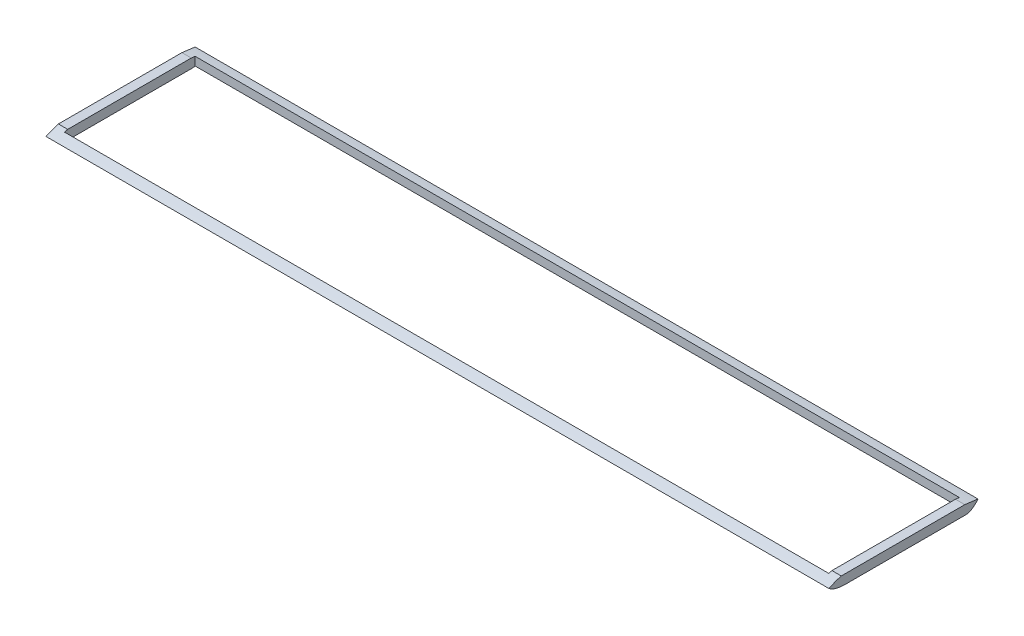
ISO-10303-21;
HEADER;
FILE_DESCRIPTION(('STEP AP214'),'2;1');
FILE_NAME('part.step','',(''),(''),'','','');
FILE_SCHEMA(('AUTOMOTIVE_DESIGN { 1 0 10303 214 1 1 1 1 }'));
ENDSEC;
DATA;
#1=APPLICATION_CONTEXT('core data for automotive mechanical design processes');
#2=APPLICATION_PROTOCOL_DEFINITION('international standard','automotive_design',2000,#1);
#3=PRODUCT_CONTEXT('',#1,'mechanical');
#4=PRODUCT('Part','Part','',(#3));
#5=PRODUCT_RELATED_PRODUCT_CATEGORY('part','',(#4));
#6=PRODUCT_DEFINITION_FORMATION('','',#4);
#7=PRODUCT_DEFINITION_CONTEXT('part definition',#1,'design');
#8=PRODUCT_DEFINITION('design','',#6,#7);
#9=PRODUCT_DEFINITION_SHAPE('','',#8);
#10=(LENGTH_UNIT() NAMED_UNIT(*) SI_UNIT(.MILLI.,.METRE.));
#11=(NAMED_UNIT(*) PLANE_ANGLE_UNIT() SI_UNIT($,.RADIAN.));
#12=(NAMED_UNIT(*) SI_UNIT($,.STERADIAN.) SOLID_ANGLE_UNIT());
#13=UNCERTAINTY_MEASURE_WITH_UNIT(LENGTH_MEASURE(1.E-05),#10,'distance_accuracy_value','');
#14=(GEOMETRIC_REPRESENTATION_CONTEXT(3) GLOBAL_UNCERTAINTY_ASSIGNED_CONTEXT((#13)) GLOBAL_UNIT_ASSIGNED_CONTEXT((#10,
#11,#12)) REPRESENTATION_CONTEXT('',''));
#15=CARTESIAN_POINT('',(0.,0.,0.));
#16=DIRECTION('',(0.,0.,1.));
#17=DIRECTION('',(1.,0.,0.));
#18=AXIS2_PLACEMENT_3D('',#15,#16,#17);
#19=CARTESIAN_POINT('',(0.,6.35,0.));
#20=DIRECTION('',(0.,1.,0.));
#21=DIRECTION('',(0.,0.,1.));
#22=AXIS2_PLACEMENT_3D('',#19,#20,#21);
#23=PLANE('',#22);
#24=DIRECTION('',(1.,0.,0.));
#25=VECTOR('',#24,1.);
#26=CARTESIAN_POINT('',(-533.4,6.35,86.8082266908897));
#27=LINE('',#26,#25);
#28=CARTESIAN_POINT('',(0.,6.35000000253614,86.8082266820428));
#29=VERTEX_POINT('',#28);
#30=CARTESIAN_POINT('',(-6.34999999999997,6.35000000253614,86.8082266820428));
#31=VERTEX_POINT('',#30);
#32=EDGE_CURVE('E11',#29,#31,#27,.F.);
#33=ORIENTED_EDGE('',*,*,#32,.F.);
#34=DIRECTION('',(0.,0.,-1.));
#35=VECTOR('',#34,1.);
#36=CARTESIAN_POINT('',(0.,6.35,0.));
#37=LINE('',#36,#35);
#38=CARTESIAN_POINT('',(0.,6.35000000001549,2.66307180460059));
#39=VERTEX_POINT('',#38);
#40=EDGE_CURVE('E233',#29,#39,#37,.T.);
#41=ORIENTED_EDGE('',*,*,#40,.T.);
#42=DIRECTION('',(1.,0.,0.));
#43=VECTOR('',#42,1.);
#44=CARTESIAN_POINT('',(-533.4,6.35,2.66307180445248));
#45=LINE('',#44,#43);
#46=CARTESIAN_POINT('',(-6.34999999999997,6.35,2.66307180445248));
#47=VERTEX_POINT('',#46);
#48=EDGE_CURVE('E289',#47,#39,#45,.T.);
#49=ORIENTED_EDGE('',*,*,#48,.F.);
#50=DIRECTION('',(0.,0.,1.));
#51=VECTOR('',#50,1.);
#52=CARTESIAN_POINT('',(-6.34999999999999,6.35,0.));
#53=LINE('',#52,#51);
#54=EDGE_CURVE('E235',#47,#31,#53,.T.);
#55=ORIENTED_EDGE('',*,*,#54,.T.);
#56=EDGE_LOOP('',(#33,#41,#49,#55));
#57=FACE_BOUND('',#56,.T.);
#58=ADVANCED_FACE('F44',(#57),#23,.T.);
#59=CARTESIAN_POINT('',(0.,0.,0.));
#60=DIRECTION('',(0.,1.,0.));
#61=DIRECTION('',(0.,0.,1.));
#62=AXIS2_PLACEMENT_3D('',#59,#60,#61);
#63=PLANE('',#62);
#64=DIRECTION('',(0.,0.,-1.));
#65=VECTOR('',#64,1.);
#66=CARTESIAN_POINT('',(-527.05,0.,0.));
#67=LINE('',#66,#65);
#68=CARTESIAN_POINT('',(-527.05,0.,84.6410730931549));
#69=VERTEX_POINT('',#68);
#70=CARTESIAN_POINT('',(-527.05,0.,1.6702089535618));
#71=VERTEX_POINT('',#70);
#72=EDGE_CURVE('E241',#69,#71,#67,.T.);
#73=ORIENTED_EDGE('',*,*,#72,.F.);
#74=DIRECTION('',(1.,0.,0.));
#75=VECTOR('',#74,1.);
#76=CARTESIAN_POINT('',(-533.4,0.,84.6410730931549));
#77=LINE('',#76,#75);
#78=CARTESIAN_POINT('',(-533.4,0.,84.6410730931549));
#79=VERTEX_POINT('',#78);
#80=EDGE_CURVE('E502',#79,#69,#77,.T.);
#81=ORIENTED_EDGE('',*,*,#80,.F.);
#82=DIRECTION('',(0.,0.,-1.));
#83=VECTOR('',#82,1.);
#84=CARTESIAN_POINT('',(-533.4,0.,0.));
#85=LINE('',#84,#83);
#86=CARTESIAN_POINT('',(-533.4,0.,1.6702089535618));
#87=VERTEX_POINT('',#86);
#88=EDGE_CURVE('E168',#79,#87,#85,.T.);
#89=ORIENTED_EDGE('',*,*,#88,.T.);
#90=DIRECTION('',(1.,0.,0.));
#91=VECTOR('',#90,1.);
#92=CARTESIAN_POINT('',(-533.4,0.,1.67020895356183));
#93=LINE('',#92,#91);
#94=EDGE_CURVE('E285',#87,#71,#93,.T.);
#95=ORIENTED_EDGE('',*,*,#94,.T.);
#96=EDGE_LOOP('',(#73,#81,#89,#95));
#97=FACE_BOUND('',#96,.T.);
#98=ADVANCED_FACE('F203',(#97),#63,.F.);
#99=CARTESIAN_POINT('',(-6.34999999999999,6.35,0.));
#100=DIRECTION('',(1.,0.,0.));
#101=DIRECTION('',(0.,0.,-1.));
#102=AXIS2_PLACEMENT_3D('',#99,#100,#101);
#103=PLANE('',#102);
#104=DIRECTION('',(0.,0.,1.));
#105=VECTOR('',#104,1.);
#106=CARTESIAN_POINT('',(-6.34999999999999,0.,0.));
#107=LINE('',#106,#105);
#108=CARTESIAN_POINT('',(-6.34999999999997,0.,1.67020895356183));
#109=VERTEX_POINT('',#108);
#110=CARTESIAN_POINT('',(-6.34999999999997,0.,84.6410730931549));
#111=VERTEX_POINT('',#110);
#112=EDGE_CURVE('E246',#109,#111,#107,.T.);
#113=ORIENTED_EDGE('',*,*,#112,.T.);
#114=CARTESIAN_POINT('',(-6.34999999999997,0.,84.6410730931549));
#115=CARTESIAN_POINT('',(-6.34999999999997,0.114428996716773,91.5442972351769));
#116=CARTESIAN_POINT('',(-6.34999999999997,3.175,95.25));
#117=B_SPLINE_CURVE_WITH_KNOTS('',2,(#114,#115,#116),.UNSPECIFIED.,.F.,.F.,(3,3),(0.,1.),.UNSPECIFIED.);
#118=CARTESIAN_POINT('',(-6.34999999999997,0.405903763749544,88.9));
#119=VERTEX_POINT('',#118);
#120=EDGE_CURVE('E543',#111,#119,#117,.T.);
#121=ORIENTED_EDGE('',*,*,#120,.T.);
#122=DIRECTION('',(0.,-1.,0.));
#123=VECTOR('',#122,1.);
#124=CARTESIAN_POINT('',(-6.34999999999998,6.35,88.9000000000001));
#125=LINE('',#124,#123);
#126=CARTESIAN_POINT('',(-6.34999999999997,5.70586290416086,88.9));
#127=VERTEX_POINT('',#126);
#128=EDGE_CURVE('E277',#127,#119,#125,.T.);
#129=ORIENTED_EDGE('',*,*,#128,.F.);
#130=CARTESIAN_POINT('',(-6.34999999999997,3.175,95.25));
#131=CARTESIAN_POINT('',(-6.34999999999997,9.22036509445145,82.3811013252065));
#132=CARTESIAN_POINT('',(-6.34999999999997,8.73649345070529,50.7788869399331));
#133=CARTESIAN_POINT('',(-6.34999999999997,7.85114906326609,10.4222164948562));
#134=CARTESIAN_POINT('',(-6.34999999999997,5.18813038406524,-6.35000000000001));
#135=B_SPLINE_CURVE_WITH_KNOTS('',3,(#130,#131,#132,#133,#134),.UNSPECIFIED.,.F.,.F.,(4,1,4),
(0.,0.372908120336852,1.),.UNSPECIFIED.);
#136=EDGE_CURVE('E261',#127,#31,#135,.T.);
#137=ORIENTED_EDGE('',*,*,#136,.T.);
#138=ORIENTED_EDGE('',*,*,#54,.F.);
#139=CARTESIAN_POINT('',(-6.34999999999997,6.05490454543101,1.29237636217749E-09));
#140=VERTEX_POINT('',#139);
#141=EDGE_CURVE('E549',#47,#140,#135,.T.);
#142=ORIENTED_EDGE('',*,*,#141,.T.);
#143=DIRECTION('',(0.,-1.,0.));
#144=VECTOR('',#143,1.);
#145=CARTESIAN_POINT('',(-6.34999999999999,6.35,0.));
#146=LINE('',#145,#144);
#147=CARTESIAN_POINT('',(-6.34999999999997,0.298477830488979,-4.48859699408999E-13));
#148=VERTEX_POINT('',#147);
#149=EDGE_CURVE('E258',#140,#148,#146,.T.);
#150=ORIENTED_EDGE('',*,*,#149,.T.);
#151=CARTESIAN_POINT('',(-6.34999999999997,5.18813038406524,-6.34999999999999));
#152=CARTESIAN_POINT('',(-6.34999999999997,-0.282902934978971,-2.02212353638556));
#153=CARTESIAN_POINT('',(-6.34999999999997,0.,2.57095307721764));
#154=B_SPLINE_CURVE_WITH_KNOTS('',2,(#151,#152,#153),.UNSPECIFIED.,.F.,.F.,(3,3),(0.,1.),.UNSPECIFIED.);
#155=EDGE_CURVE('E508',#148,#109,#154,.T.);
#156=ORIENTED_EDGE('',*,*,#155,.T.);
#157=EDGE_LOOP('',(#113,#121,#129,#137,#138,#142,#150,#156));
#158=FACE_BOUND('',#157,.T.);
#159=ADVANCED_FACE('F214',(#158),#103,.F.);
#160=CARTESIAN_POINT('',(0.,6.35,88.9000000000001));
#161=DIRECTION('',(0.,0.,1.));
#162=DIRECTION('',(1.,0.,0.));
#163=AXIS2_PLACEMENT_3D('',#160,#161,#162);
#164=PLANE('',#163);
#165=ORIENTED_EDGE('',*,*,#128,.T.);
#166=DIRECTION('',(1.,0.,0.));
#167=VECTOR('',#166,1.);
#168=CARTESIAN_POINT('',(-533.4,0.405903763749544,88.9));
#169=LINE('',#168,#167);
#170=CARTESIAN_POINT('',(-527.05,0.405903764964106,88.9000000064445));
#171=VERTEX_POINT('',#170);
#172=EDGE_CURVE('E536',#119,#171,#169,.F.);
#173=ORIENTED_EDGE('',*,*,#172,.T.);
#174=DIRECTION('',(0.,-1.,0.));
#175=VECTOR('',#174,1.);
#176=CARTESIAN_POINT('',(-527.05,6.35,88.9000000000001));
#177=LINE('',#176,#175);
#178=CARTESIAN_POINT('',(-527.05,5.7058629041627,88.8999999999945));
#179=VERTEX_POINT('',#178);
#180=EDGE_CURVE('E273',#179,#171,#177,.T.);
#181=ORIENTED_EDGE('',*,*,#180,.F.);
#182=DIRECTION('',(1.,0.,0.));
#183=VECTOR('',#182,1.);
#184=CARTESIAN_POINT('',(-533.4,5.70586290416086,88.9));
#185=LINE('',#184,#183);
#186=EDGE_CURVE('E249',#179,#127,#185,.T.);
#187=ORIENTED_EDGE('',*,*,#186,.T.);
#188=EDGE_LOOP('',(#165,#173,#181,#187));
#189=FACE_BOUND('',#188,.T.);
#190=ADVANCED_FACE('F210',(#189),#164,.F.);
#191=CARTESIAN_POINT('',(-527.05,6.35,0.));
#192=DIRECTION('',(-1.,0.,0.));
#193=DIRECTION('',(0.,0.,1.));
#194=AXIS2_PLACEMENT_3D('',#191,#192,#193);
#195=PLANE('',#194);
#196=ORIENTED_EDGE('',*,*,#180,.T.);
#197=CARTESIAN_POINT('',(-527.05,0.,84.6410730931549));
#198=CARTESIAN_POINT('',(-527.05,0.114428996716773,91.5442972351769));
#199=CARTESIAN_POINT('',(-527.05,3.175,95.25));
#200=B_SPLINE_CURVE_WITH_KNOTS('',2,(#197,#198,#199),.UNSPECIFIED.,.F.,.F.,(3,3),(0.,1.),.UNSPECIFIED.);
#201=EDGE_CURVE('E527',#171,#69,#200,.F.);
#202=ORIENTED_EDGE('',*,*,#201,.T.);
#203=ORIENTED_EDGE('',*,*,#72,.T.);
#204=CARTESIAN_POINT('',(-527.05,5.18813038406524,-6.34999999999999));
#205=CARTESIAN_POINT('',(-527.05,-0.282902934978971,-2.02212353638556));
#206=CARTESIAN_POINT('',(-527.05,0.,2.57095307721764));
#207=B_SPLINE_CURVE_WITH_KNOTS('',2,(#204,#205,#206),.UNSPECIFIED.,.F.,.F.,(3,3),(0.,1.),.UNSPECIFIED.);
#208=CARTESIAN_POINT('',(-527.05,0.298477830488845,0.));
#209=VERTEX_POINT('',#208);
#210=EDGE_CURVE('E522',#71,#209,#207,.F.);
#211=ORIENTED_EDGE('',*,*,#210,.T.);
#212=DIRECTION('',(0.,-1.,0.));
#213=VECTOR('',#212,1.);
#214=CARTESIAN_POINT('',(-527.05,6.35,0.));
#215=LINE('',#214,#213);
#216=CARTESIAN_POINT('',(-527.05,6.05490454527933,0.));
#217=VERTEX_POINT('',#216);
#218=EDGE_CURVE('E269',#217,#209,#215,.T.);
#219=ORIENTED_EDGE('',*,*,#218,.F.);
#220=CARTESIAN_POINT('',(-527.05,3.175,95.25));
#221=CARTESIAN_POINT('',(-527.05,9.22036509445145,82.3811013252065));
#222=CARTESIAN_POINT('',(-527.05,8.73649345070529,50.7788869399331));
#223=CARTESIAN_POINT('',(-527.05,7.85114906326609,10.4222164948562));
#224=CARTESIAN_POINT('',(-527.05,5.18813038406524,-6.35000000000001));
#225=B_SPLINE_CURVE_WITH_KNOTS('',3,(#220,#221,#222,#223,#224),.UNSPECIFIED.,.F.,.F.,(4,1,4),
(0.,0.372908120336852,1.),.UNSPECIFIED.);
#226=CARTESIAN_POINT('',(-527.05,6.35000000001549,2.66307180460059));
#227=VERTEX_POINT('',#226);
#228=EDGE_CURVE('E297',#217,#227,#225,.F.);
#229=ORIENTED_EDGE('',*,*,#228,.T.);
#230=DIRECTION('',(0.,0.,-1.));
#231=VECTOR('',#230,1.);
#232=CARTESIAN_POINT('',(-527.05,6.35,0.));
#233=LINE('',#232,#231);
#234=CARTESIAN_POINT('',(-527.05,6.35,86.8082266908897));
#235=VERTEX_POINT('',#234);
#236=EDGE_CURVE('E254',#235,#227,#233,.T.);
#237=ORIENTED_EDGE('',*,*,#236,.F.);
#238=EDGE_CURVE('E304',#235,#179,#225,.F.);
#239=ORIENTED_EDGE('',*,*,#238,.T.);
#240=EDGE_LOOP('',(#196,#202,#203,#211,#219,#229,#237,#239));
#241=FACE_BOUND('',#240,.T.);
#242=ADVANCED_FACE('F207',(#241),#195,.F.);
#243=CARTESIAN_POINT('',(0.,6.35,0.));
#244=DIRECTION('',(-1.,0.,0.));
#245=DIRECTION('',(0.,0.,1.));
#246=AXIS2_PLACEMENT_3D('',#243,#244,#245);
#247=PLANE('',#246);
#248=DIRECTION('',(0.,0.,-1.));
#249=VECTOR('',#248,1.);
#250=CARTESIAN_POINT('',(0.,0.,0.));
#251=LINE('',#250,#249);
#252=CARTESIAN_POINT('',(0.,0.,84.6410730931549));
#253=VERTEX_POINT('',#252);
#254=CARTESIAN_POINT('',(0.,0.,1.6702089535618));
#255=VERTEX_POINT('',#254);
#256=EDGE_CURVE('E60',#253,#255,#251,.T.);
#257=ORIENTED_EDGE('',*,*,#256,.T.);
#258=CARTESIAN_POINT('',(0.,5.18813038406524,-6.34999999999999));
#259=CARTESIAN_POINT('',(0.,-0.282902934978971,-2.02212353638556));
#260=CARTESIAN_POINT('',(0.,0.,2.57095307721764));
#261=B_SPLINE_CURVE_WITH_KNOTS('',2,(#258,#259,#260),.UNSPECIFIED.,.F.,.F.,(3,3),(0.,1.),.UNSPECIFIED.);
#262=CARTESIAN_POINT('',(0.,5.18813038406524,-6.35000000000001));
#263=VERTEX_POINT('',#262);
#264=EDGE_CURVE('E170',#263,#255,#261,.T.);
#265=ORIENTED_EDGE('',*,*,#264,.F.);
#266=CARTESIAN_POINT('',(0.,3.175,95.25));
#267=CARTESIAN_POINT('',(0.,9.22036509445145,82.3811013252065));
#268=CARTESIAN_POINT('',(0.,8.73649345070529,50.7788869399331));
#269=CARTESIAN_POINT('',(0.,7.85114906326609,10.4222164948562));
#270=CARTESIAN_POINT('',(0.,5.18813038406524,-6.35000000000001));
#271=B_SPLINE_CURVE_WITH_KNOTS('',3,(#266,#267,#268,#269,#270),.UNSPECIFIED.,.F.,.F.,(4,1,4),
(0.,0.372908120336852,1.),.UNSPECIFIED.);
#272=EDGE_CURVE('E238',#39,#263,#271,.T.);
#273=ORIENTED_EDGE('',*,*,#272,.F.);
#274=ORIENTED_EDGE('',*,*,#40,.F.);
#275=CARTESIAN_POINT('',(0.,3.175,95.25));
#276=VERTEX_POINT('',#275);
#277=EDGE_CURVE('E175',#276,#29,#271,.T.);
#278=ORIENTED_EDGE('',*,*,#277,.F.);
#279=CARTESIAN_POINT('',(0.,0.,84.6410730931549));
#280=CARTESIAN_POINT('',(0.,0.114428996716773,91.5442972351769));
#281=CARTESIAN_POINT('',(0.,3.175,95.25));
#282=B_SPLINE_CURVE_WITH_KNOTS('',2,(#279,#280,#281),.UNSPECIFIED.,.F.,.F.,(3,3),(0.,1.),.UNSPECIFIED.);
#283=EDGE_CURVE('E148',#253,#276,#282,.T.);
#284=ORIENTED_EDGE('',*,*,#283,.F.);
#285=EDGE_LOOP('',(#257,#265,#273,#274,#278,#284));
#286=FACE_BOUND('',#285,.T.);
#287=ADVANCED_FACE('F46',(#286),#247,.F.);
#288=CARTESIAN_POINT('',(-533.4,6.35,0.));
#289=DIRECTION('',(-1.,0.,0.));
#290=DIRECTION('',(0.,0.,1.));
#291=AXIS2_PLACEMENT_3D('',#288,#289,#290);
#292=PLANE('',#291);
#293=CARTESIAN_POINT('',(-533.4,5.18813038406524,-6.34999999999999));
#294=CARTESIAN_POINT('',(-533.4,-0.282902934978971,-2.02212353638556));
#295=CARTESIAN_POINT('',(-533.4,0.,2.57095307721764));
#296=B_SPLINE_CURVE_WITH_KNOTS('',2,(#293,#294,#295),.UNSPECIFIED.,.F.,.F.,(3,3),(0.,1.),.UNSPECIFIED.);
#297=CARTESIAN_POINT('',(-533.4,5.18813038406524,-6.35000000000001));
#298=VERTEX_POINT('',#297);
#299=EDGE_CURVE('E153',#298,#87,#296,.T.);
#300=ORIENTED_EDGE('',*,*,#299,.T.);
#301=ORIENTED_EDGE('',*,*,#88,.F.);
#302=CARTESIAN_POINT('',(-533.4,0.,84.6410730931549));
#303=CARTESIAN_POINT('',(-533.4,0.114428996716773,91.5442972351769));
#304=CARTESIAN_POINT('',(-533.4,3.175,95.25));
#305=B_SPLINE_CURVE_WITH_KNOTS('',2,(#302,#303,#304),.UNSPECIFIED.,.F.,.F.,(3,3),(0.,1.),.UNSPECIFIED.);
#306=CARTESIAN_POINT('',(-533.4,3.175,95.25));
#307=VERTEX_POINT('',#306);
#308=EDGE_CURVE('E68',#79,#307,#305,.T.);
#309=ORIENTED_EDGE('',*,*,#308,.T.);
#310=CARTESIAN_POINT('',(-533.4,3.175,95.25));
#311=CARTESIAN_POINT('',(-533.4,9.22036509445145,82.3811013252065));
#312=CARTESIAN_POINT('',(-533.4,8.73649345070529,50.7788869399331));
#313=CARTESIAN_POINT('',(-533.4,7.85114906326609,10.4222164948562));
#314=CARTESIAN_POINT('',(-533.4,5.18813038406524,-6.35000000000001));
#315=B_SPLINE_CURVE_WITH_KNOTS('',3,(#310,#311,#312,#313,#314),.UNSPECIFIED.,.F.,.F.,(4,1,4),
(0.,0.372908120336852,1.),.UNSPECIFIED.);
#316=CARTESIAN_POINT('',(-533.4,6.35000000253614,86.8082266820428));
#317=VERTEX_POINT('',#316);
#318=EDGE_CURVE('E156',#307,#317,#315,.T.);
#319=ORIENTED_EDGE('',*,*,#318,.T.);
#320=DIRECTION('',(0.,0.,-1.));
#321=VECTOR('',#320,1.);
#322=CARTESIAN_POINT('',(-533.4,6.35,0.));
#323=LINE('',#322,#321);
#324=CARTESIAN_POINT('',(-533.4,6.35000000001549,2.66307180460059));
#325=VERTEX_POINT('',#324);
#326=EDGE_CURVE('E240',#317,#325,#323,.T.);
#327=ORIENTED_EDGE('',*,*,#326,.T.);
#328=EDGE_CURVE('E163',#325,#298,#315,.T.);
#329=ORIENTED_EDGE('',*,*,#328,.T.);
#330=EDGE_LOOP('',(#300,#301,#309,#319,#327,#329));
#331=FACE_BOUND('',#330,.T.);
#332=ADVANCED_FACE('F167',(#331),#292,.T.);
#333=CARTESIAN_POINT('',(0.,6.35,0.));
#334=DIRECTION('',(0.,0.,1.));
#335=DIRECTION('',(1.,0.,0.));
#336=AXIS2_PLACEMENT_3D('',#333,#334,#335);
#337=PLANE('',#336);
#338=DIRECTION('',(1.,0.,0.));
#339=VECTOR('',#338,1.);
#340=CARTESIAN_POINT('',(-533.4,0.298477830488845,0.));
#341=LINE('',#340,#339);
#342=EDGE_CURVE('E516',#148,#209,#341,.F.);
#343=ORIENTED_EDGE('',*,*,#342,.F.);
#344=ORIENTED_EDGE('',*,*,#149,.F.);
#345=DIRECTION('',(1.,0.,0.));
#346=VECTOR('',#345,1.);
#347=CARTESIAN_POINT('',(-533.4,6.05490454527933,0.));
#348=LINE('',#347,#346);
#349=EDGE_CURVE('E305',#217,#140,#348,.T.);
#350=ORIENTED_EDGE('',*,*,#349,.F.);
#351=ORIENTED_EDGE('',*,*,#218,.T.);
#352=EDGE_LOOP('',(#343,#344,#350,#351));
#353=FACE_BOUND('',#352,.T.);
#354=ADVANCED_FACE('F197',(#353),#337,.T.);
#355=EDGE_CURVE('E48',#235,#317,#27,.F.);
#356=ORIENTED_EDGE('',*,*,#355,.F.);
#357=ORIENTED_EDGE('',*,*,#236,.T.);
#358=EDGE_CURVE('E291',#325,#227,#45,.T.);
#359=ORIENTED_EDGE('',*,*,#358,.F.);
#360=ORIENTED_EDGE('',*,*,#326,.F.);
#361=EDGE_LOOP('',(#356,#357,#359,#360));
#362=FACE_BOUND('',#361,.T.);
#363=ADVANCED_FACE('F193',(#362),#23,.T.);
#364=ORIENTED_EDGE('',*,*,#112,.F.);
#365=EDGE_CURVE('E281',#109,#255,#93,.T.);
#366=ORIENTED_EDGE('',*,*,#365,.T.);
#367=ORIENTED_EDGE('',*,*,#256,.F.);
#368=DIRECTION('',(-1.,0.,0.));
#369=VECTOR('',#368,1.);
#370=CARTESIAN_POINT('',(0.,0.,84.6410730931549));
#371=LINE('',#370,#369);
#372=EDGE_CURVE('E286',#253,#111,#371,.T.);
#373=ORIENTED_EDGE('',*,*,#372,.T.);
#374=EDGE_LOOP('',(#364,#366,#367,#373));
#375=FACE_BOUND('',#374,.T.);
#376=ADVANCED_FACE('F196',(#375),#63,.F.);
#377=DIRECTION('',(1.,0.,0.));
#378=VECTOR('',#377,1.);
#379=SURFACE_OF_LINEAR_EXTRUSION('',#296,#378);
#380=ORIENTED_EDGE('',*,*,#299,.F.);
#381=DIRECTION('',(1.,0.,0.));
#382=VECTOR('',#381,1.);
#383=CARTESIAN_POINT('',(-533.4,5.18813038406524,-6.35000000000001));
#384=LINE('',#383,#382);
#385=EDGE_CURVE('E152',#298,#263,#384,.T.);
#386=ORIENTED_EDGE('',*,*,#385,.T.);
#387=ORIENTED_EDGE('',*,*,#264,.T.);
#388=ORIENTED_EDGE('',*,*,#365,.F.);
#389=ORIENTED_EDGE('',*,*,#155,.F.);
#390=ORIENTED_EDGE('',*,*,#342,.T.);
#391=ORIENTED_EDGE('',*,*,#210,.F.);
#392=ORIENTED_EDGE('',*,*,#94,.F.);
#393=EDGE_LOOP('',(#380,#386,#387,#388,#389,#390,#391,#392));
#394=FACE_BOUND('',#393,.T.);
#395=ADVANCED_FACE('F201',(#394),#379,.F.);
#396=DIRECTION('',(1.,0.,0.));
#397=VECTOR('',#396,1.);
#398=SURFACE_OF_LINEAR_EXTRUSION('',#315,#397);
#399=ORIENTED_EDGE('',*,*,#358,.T.);
#400=ORIENTED_EDGE('',*,*,#228,.F.);
#401=ORIENTED_EDGE('',*,*,#349,.T.);
#402=ORIENTED_EDGE('',*,*,#141,.F.);
#403=ORIENTED_EDGE('',*,*,#48,.T.);
#404=ORIENTED_EDGE('',*,*,#272,.T.);
#405=ORIENTED_EDGE('',*,*,#385,.F.);
#406=ORIENTED_EDGE('',*,*,#328,.F.);
#407=EDGE_LOOP('',(#399,#400,#401,#402,#403,#404,#405,#406));
#408=FACE_BOUND('',#407,.T.);
#409=ADVANCED_FACE('F191',(#408),#398,.F.);
#410=ORIENTED_EDGE('',*,*,#32,.T.);
#411=ORIENTED_EDGE('',*,*,#136,.F.);
#412=ORIENTED_EDGE('',*,*,#186,.F.);
#413=ORIENTED_EDGE('',*,*,#238,.F.);
#414=ORIENTED_EDGE('',*,*,#355,.T.);
#415=ORIENTED_EDGE('',*,*,#318,.F.);
#416=DIRECTION('',(1.,0.,0.));
#417=VECTOR('',#416,1.);
#418=CARTESIAN_POINT('',(-533.4,3.175,95.25));
#419=LINE('',#418,#417);
#420=EDGE_CURVE('E145',#307,#276,#419,.T.);
#421=ORIENTED_EDGE('',*,*,#420,.T.);
#422=ORIENTED_EDGE('',*,*,#277,.T.);
#423=EDGE_LOOP('',(#410,#411,#412,#413,#414,#415,#421,#422));
#424=FACE_BOUND('',#423,.T.);
#425=ADVANCED_FACE('F157',(#424),#398,.F.);
#426=DIRECTION('',(1.,0.,0.));
#427=VECTOR('',#426,1.);
#428=SURFACE_OF_LINEAR_EXTRUSION('',#305,#427);
#429=ORIENTED_EDGE('',*,*,#372,.F.);
#430=ORIENTED_EDGE('',*,*,#283,.T.);
#431=ORIENTED_EDGE('',*,*,#420,.F.);
#432=ORIENTED_EDGE('',*,*,#308,.F.);
#433=ORIENTED_EDGE('',*,*,#80,.T.);
#434=ORIENTED_EDGE('',*,*,#201,.F.);
#435=ORIENTED_EDGE('',*,*,#172,.F.);
#436=ORIENTED_EDGE('',*,*,#120,.F.);
#437=EDGE_LOOP('',(#429,#430,#431,#432,#433,#434,#435,#436));
#438=FACE_BOUND('',#437,.T.);
#439=ADVANCED_FACE('F147',(#438),#428,.F.);
#440=CLOSED_SHELL('',(#58,#98,#159,#190,#242,#287,#332,#354,#363,#376,#395,#409,#425,#439));
#441=MANIFOLD_SOLID_BREP('B2',#440);
#442=ADVANCED_BREP_SHAPE_REPRESENTATION('',(#18,#441),#14);
#443=SHAPE_DEFINITION_REPRESENTATION(#9,#442);
ENDSEC;
END-ISO-10303-21;
